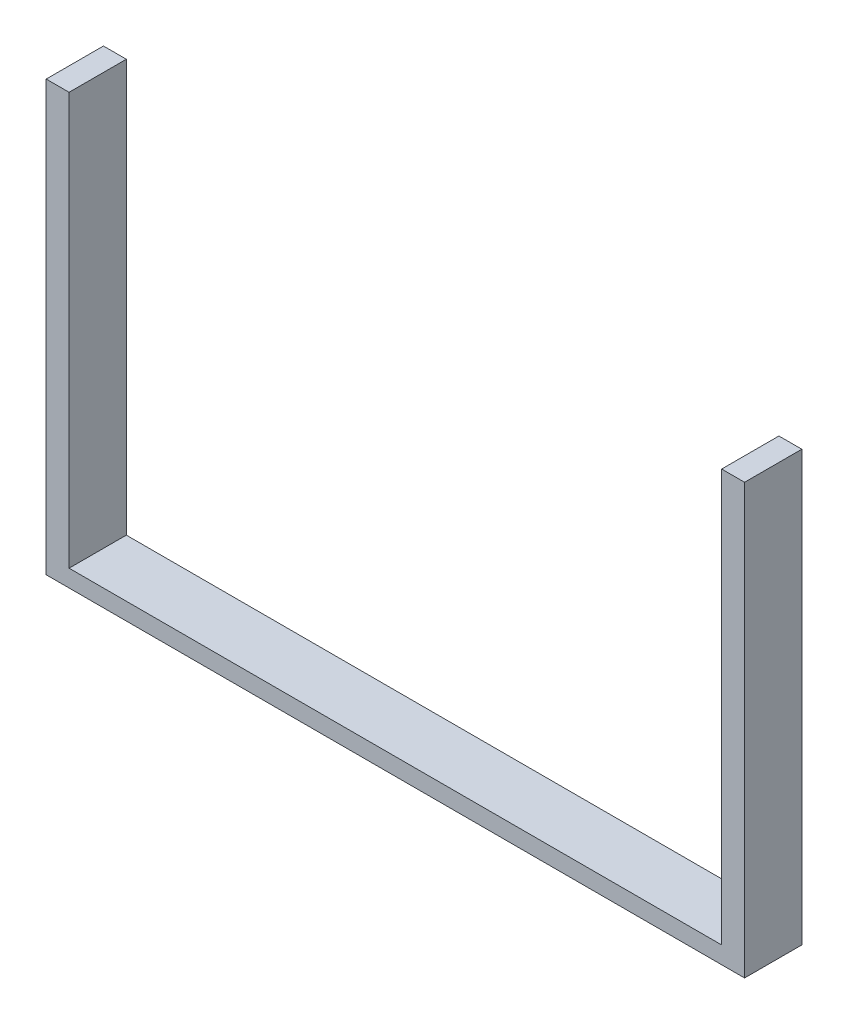
ISO-10303-21;
HEADER;
FILE_DESCRIPTION(('STEP AP214'),'2;1');
FILE_NAME('part.step','',(''),(''),'','','');
FILE_SCHEMA(('AUTOMOTIVE_DESIGN { 1 0 10303 214 1 1 1 1 }'));
ENDSEC;
DATA;
#1=APPLICATION_CONTEXT('core data for automotive mechanical design processes');
#2=APPLICATION_PROTOCOL_DEFINITION('international standard','automotive_design',2000,#1);
#3=PRODUCT_CONTEXT('',#1,'mechanical');
#4=PRODUCT('Part','Part','',(#3));
#5=PRODUCT_RELATED_PRODUCT_CATEGORY('part','',(#4));
#6=PRODUCT_DEFINITION_FORMATION('','',#4);
#7=PRODUCT_DEFINITION_CONTEXT('part definition',#1,'design');
#8=PRODUCT_DEFINITION('design','',#6,#7);
#9=PRODUCT_DEFINITION_SHAPE('','',#8);
#10=(LENGTH_UNIT() NAMED_UNIT(*) SI_UNIT(.MILLI.,.METRE.));
#11=(NAMED_UNIT(*) PLANE_ANGLE_UNIT() SI_UNIT($,.RADIAN.));
#12=(NAMED_UNIT(*) SI_UNIT($,.STERADIAN.) SOLID_ANGLE_UNIT());
#13=UNCERTAINTY_MEASURE_WITH_UNIT(LENGTH_MEASURE(1.E-05),#10,'distance_accuracy_value','');
#14=(GEOMETRIC_REPRESENTATION_CONTEXT(3) GLOBAL_UNCERTAINTY_ASSIGNED_CONTEXT((#13)) GLOBAL_UNIT_ASSIGNED_CONTEXT((#10,
#11,#12)) REPRESENTATION_CONTEXT('',''));
#15=CARTESIAN_POINT('',(0.,0.,0.));
#16=DIRECTION('',(0.,0.,1.));
#17=DIRECTION('',(1.,0.,0.));
#18=AXIS2_PLACEMENT_3D('',#15,#16,#17);
#19=CARTESIAN_POINT('',(-61.,3.,132.03687967168));
#20=DIRECTION('',(0.,-1.,0.));
#21=DIRECTION('',(0.,0.,-1.));
#22=AXIS2_PLACEMENT_3D('',#19,#20,#21);
#23=PLANE('',#22);
#24=DIRECTION('',(0.,0.,1.));
#25=VECTOR('',#24,1.);
#26=CARTESIAN_POINT('',(57.,3.,132.03687967168));
#27=LINE('',#26,#25);
#28=CARTESIAN_POINT('',(57.,3.,0.));
#29=VERTEX_POINT('',#28);
#30=CARTESIAN_POINT('',(57.,3.,9.99999999999999));
#31=VERTEX_POINT('',#30);
#32=EDGE_CURVE('E11',#29,#31,#27,.T.);
#33=ORIENTED_EDGE('',*,*,#32,.F.);
#34=DIRECTION('',(-1.,0.,0.));
#35=VECTOR('',#34,1.);
#36=CARTESIAN_POINT('',(-61.,3.,0.));
#37=LINE('',#36,#35);
#38=CARTESIAN_POINT('',(-57.,3.,0.));
#39=VERTEX_POINT('',#38);
#40=EDGE_CURVE('E117',#29,#39,#37,.T.);
#41=ORIENTED_EDGE('',*,*,#40,.T.);
#42=DIRECTION('',(0.,0.,1.));
#43=VECTOR('',#42,1.);
#44=CARTESIAN_POINT('',(-57.,3.,10.));
#45=LINE('',#44,#43);
#46=CARTESIAN_POINT('',(-57.,3.,10.));
#47=VERTEX_POINT('',#46);
#48=EDGE_CURVE('E122',#39,#47,#45,.T.);
#49=ORIENTED_EDGE('',*,*,#48,.T.);
#50=DIRECTION('',(1.,0.,0.));
#51=VECTOR('',#50,1.);
#52=CARTESIAN_POINT('',(-61.,3.,9.99999999999999));
#53=LINE('',#52,#51);
#54=EDGE_CURVE('E46',#47,#31,#53,.T.);
#55=ORIENTED_EDGE('',*,*,#54,.T.);
#56=EDGE_LOOP('',(#33,#41,#49,#55));
#57=FACE_BOUND('',#56,.T.);
#58=ADVANCED_FACE('F31',(#57),#23,.F.);
#59=CARTESIAN_POINT('',(-57.,75.,10.));
#60=DIRECTION('',(-1.,0.,0.));
#61=DIRECTION('',(0.,0.,1.));
#62=AXIS2_PLACEMENT_3D('',#59,#60,#61);
#63=PLANE('',#62);
#64=ORIENTED_EDGE('',*,*,#48,.F.);
#65=DIRECTION('',(0.,1.,0.));
#66=VECTOR('',#65,1.);
#67=CARTESIAN_POINT('',(-57.,75.,0.));
#68=LINE('',#67,#66);
#69=CARTESIAN_POINT('',(-57.,75.,0.));
#70=VERTEX_POINT('',#69);
#71=EDGE_CURVE('E135',#39,#70,#68,.T.);
#72=ORIENTED_EDGE('',*,*,#71,.T.);
#73=DIRECTION('',(0.,0.,-1.));
#74=VECTOR('',#73,1.);
#75=CARTESIAN_POINT('',(-57.,75.,10.));
#76=LINE('',#75,#74);
#77=CARTESIAN_POINT('',(-57.,75.,10.));
#78=VERTEX_POINT('',#77);
#79=EDGE_CURVE('E141',#78,#70,#76,.T.);
#80=ORIENTED_EDGE('',*,*,#79,.F.);
#81=DIRECTION('',(0.,1.,0.));
#82=VECTOR('',#81,1.);
#83=CARTESIAN_POINT('',(-57.,75.,10.));
#84=LINE('',#83,#82);
#85=EDGE_CURVE('E139',#47,#78,#84,.T.);
#86=ORIENTED_EDGE('',*,*,#85,.F.);
#87=EDGE_LOOP('',(#64,#72,#80,#86));
#88=FACE_BOUND('',#87,.T.);
#89=ADVANCED_FACE('F176',(#88),#63,.F.);
#90=CARTESIAN_POINT('',(-61.,75.,10.));
#91=DIRECTION('',(0.,-1.,0.));
#92=DIRECTION('',(0.,0.,-1.));
#93=AXIS2_PLACEMENT_3D('',#90,#91,#92);
#94=PLANE('',#93);
#95=DIRECTION('',(-1.,0.,0.));
#96=VECTOR('',#95,1.);
#97=CARTESIAN_POINT('',(-61.,75.,0.));
#98=LINE('',#97,#96);
#99=CARTESIAN_POINT('',(-61.,75.,0.));
#100=VERTEX_POINT('',#99);
#101=EDGE_CURVE('E130',#70,#100,#98,.T.);
#102=ORIENTED_EDGE('',*,*,#101,.T.);
#103=DIRECTION('',(0.,0.,-1.));
#104=VECTOR('',#103,1.);
#105=CARTESIAN_POINT('',(-61.,75.,10.));
#106=LINE('',#105,#104);
#107=CARTESIAN_POINT('',(-61.,75.,10.));
#108=VERTEX_POINT('',#107);
#109=EDGE_CURVE('E39',#108,#100,#106,.T.);
#110=ORIENTED_EDGE('',*,*,#109,.F.);
#111=DIRECTION('',(-1.,0.,0.));
#112=VECTOR('',#111,1.);
#113=CARTESIAN_POINT('',(-61.,75.,10.));
#114=LINE('',#113,#112);
#115=EDGE_CURVE('E131',#78,#108,#114,.T.);
#116=ORIENTED_EDGE('',*,*,#115,.F.);
#117=ORIENTED_EDGE('',*,*,#79,.T.);
#118=EDGE_LOOP('',(#102,#110,#116,#117));
#119=FACE_BOUND('',#118,.T.);
#120=ADVANCED_FACE('F33',(#119),#94,.F.);
#121=CARTESIAN_POINT('',(-61.,75.,10.));
#122=DIRECTION('',(1.,0.,0.));
#123=DIRECTION('',(0.,0.,-1.));
#124=AXIS2_PLACEMENT_3D('',#121,#122,#123);
#125=PLANE('',#124);
#126=DIRECTION('',(0.,0.,-1.));
#127=VECTOR('',#126,1.);
#128=CARTESIAN_POINT('',(-61.,0.,10.));
#129=LINE('',#128,#127);
#130=CARTESIAN_POINT('',(-61.,0.,10.));
#131=VERTEX_POINT('',#130);
#132=CARTESIAN_POINT('',(-61.,0.,0.));
#133=VERTEX_POINT('',#132);
#134=EDGE_CURVE('E151',#131,#133,#129,.T.);
#135=ORIENTED_EDGE('',*,*,#134,.F.);
#136=DIRECTION('',(0.,-1.,0.));
#137=VECTOR('',#136,1.);
#138=CARTESIAN_POINT('',(-61.,75.,10.));
#139=LINE('',#138,#137);
#140=EDGE_CURVE('E134',#108,#131,#139,.T.);
#141=ORIENTED_EDGE('',*,*,#140,.F.);
#142=ORIENTED_EDGE('',*,*,#109,.T.);
#143=DIRECTION('',(0.,-1.,0.));
#144=VECTOR('',#143,1.);
#145=CARTESIAN_POINT('',(-61.,75.,0.));
#146=LINE('',#145,#144);
#147=EDGE_CURVE('E144',#100,#133,#146,.T.);
#148=ORIENTED_EDGE('',*,*,#147,.T.);
#149=EDGE_LOOP('',(#135,#141,#142,#148));
#150=FACE_BOUND('',#149,.T.);
#151=ADVANCED_FACE('F157',(#150),#125,.F.);
#152=CARTESIAN_POINT('',(-57.,0.,10.));
#153=DIRECTION('',(0.,1.,0.));
#154=DIRECTION('',(-1.,0.,0.));
#155=AXIS2_PLACEMENT_3D('',#152,#153,#154);
#156=PLANE('',#155);
#157=DIRECTION('',(0.,0.,-1.));
#158=VECTOR('',#157,1.);
#159=CARTESIAN_POINT('',(61.,0.,132.03687967168));
#160=LINE('',#159,#158);
#161=CARTESIAN_POINT('',(61.,0.,9.99999999999999));
#162=VERTEX_POINT('',#161);
#163=CARTESIAN_POINT('',(61.,0.,0.));
#164=VERTEX_POINT('',#163);
#165=EDGE_CURVE('E125',#162,#164,#160,.T.);
#166=ORIENTED_EDGE('',*,*,#165,.F.);
#167=DIRECTION('',(1.,0.,0.));
#168=VECTOR('',#167,1.);
#169=CARTESIAN_POINT('',(-57.,0.,10.));
#170=LINE('',#169,#168);
#171=EDGE_CURVE('E137',#131,#162,#170,.T.);
#172=ORIENTED_EDGE('',*,*,#171,.F.);
#173=ORIENTED_EDGE('',*,*,#134,.T.);
#174=DIRECTION('',(1.,0.,0.));
#175=VECTOR('',#174,1.);
#176=CARTESIAN_POINT('',(-57.,0.,0.));
#177=LINE('',#176,#175);
#178=EDGE_CURVE('E146',#133,#164,#177,.T.);
#179=ORIENTED_EDGE('',*,*,#178,.T.);
#180=EDGE_LOOP('',(#166,#172,#173,#179));
#181=FACE_BOUND('',#180,.T.);
#182=ADVANCED_FACE('F169',(#181),#156,.F.);
#183=CARTESIAN_POINT('',(-57.,75.,10.));
#184=DIRECTION('',(0.,0.,-1.));
#185=DIRECTION('',(-1.,0.,0.));
#186=AXIS2_PLACEMENT_3D('',#183,#184,#185);
#187=PLANE('',#186);
#188=DIRECTION('',(0.,-1.,0.));
#189=VECTOR('',#188,1.);
#190=CARTESIAN_POINT('',(61.,0.,9.99999999999999));
#191=LINE('',#190,#189);
#192=CARTESIAN_POINT('',(61.,75.,10.));
#193=VERTEX_POINT('',#192);
#194=EDGE_CURVE('E106',#193,#162,#191,.T.);
#195=ORIENTED_EDGE('',*,*,#194,.F.);
#196=DIRECTION('',(-1.,0.,0.));
#197=VECTOR('',#196,1.);
#198=CARTESIAN_POINT('',(61.,75.,10.));
#199=LINE('',#198,#197);
#200=CARTESIAN_POINT('',(57.,75.,10.));
#201=VERTEX_POINT('',#200);
#202=EDGE_CURVE('E101',#193,#201,#199,.T.);
#203=ORIENTED_EDGE('',*,*,#202,.T.);
#204=DIRECTION('',(0.,-1.,0.));
#205=VECTOR('',#204,1.);
#206=CARTESIAN_POINT('',(57.,75.,10.));
#207=LINE('',#206,#205);
#208=EDGE_CURVE('E93',#201,#31,#207,.T.);
#209=ORIENTED_EDGE('',*,*,#208,.T.);
#210=ORIENTED_EDGE('',*,*,#54,.F.);
#211=ORIENTED_EDGE('',*,*,#85,.T.);
#212=ORIENTED_EDGE('',*,*,#115,.T.);
#213=ORIENTED_EDGE('',*,*,#140,.T.);
#214=ORIENTED_EDGE('',*,*,#171,.T.);
#215=EDGE_LOOP('',(#195,#203,#209,#210,#211,#212,#213,#214));
#216=FACE_BOUND('',#215,.T.);
#217=ADVANCED_FACE('F104',(#216),#187,.F.);
#218=CARTESIAN_POINT('',(-57.,75.,0.));
#219=DIRECTION('',(0.,0.,-1.));
#220=DIRECTION('',(-1.,0.,0.));
#221=AXIS2_PLACEMENT_3D('',#218,#219,#220);
#222=PLANE('',#221);
#223=DIRECTION('',(0.,1.,0.));
#224=VECTOR('',#223,1.);
#225=CARTESIAN_POINT('',(61.,0.,0.));
#226=LINE('',#225,#224);
#227=CARTESIAN_POINT('',(61.,75.,0.));
#228=VERTEX_POINT('',#227);
#229=EDGE_CURVE('E115',#164,#228,#226,.T.);
#230=ORIENTED_EDGE('',*,*,#229,.F.);
#231=ORIENTED_EDGE('',*,*,#178,.F.);
#232=ORIENTED_EDGE('',*,*,#147,.F.);
#233=ORIENTED_EDGE('',*,*,#101,.F.);
#234=ORIENTED_EDGE('',*,*,#71,.F.);
#235=ORIENTED_EDGE('',*,*,#40,.F.);
#236=DIRECTION('',(0.,-1.,0.));
#237=VECTOR('',#236,1.);
#238=CARTESIAN_POINT('',(57.,75.,0.));
#239=LINE('',#238,#237);
#240=CARTESIAN_POINT('',(57.,75.,0.));
#241=VERTEX_POINT('',#240);
#242=EDGE_CURVE('E110',#241,#29,#239,.T.);
#243=ORIENTED_EDGE('',*,*,#242,.F.);
#244=DIRECTION('',(-1.,0.,0.));
#245=VECTOR('',#244,1.);
#246=CARTESIAN_POINT('',(61.,75.,0.));
#247=LINE('',#246,#245);
#248=EDGE_CURVE('E114',#228,#241,#247,.T.);
#249=ORIENTED_EDGE('',*,*,#248,.F.);
#250=EDGE_LOOP('',(#230,#231,#232,#233,#234,#235,#243,#249));
#251=FACE_BOUND('',#250,.T.);
#252=ADVANCED_FACE('F165',(#251),#222,.T.);
#253=CARTESIAN_POINT('',(61.,0.,132.03687967168));
#254=DIRECTION('',(-1.,0.,0.));
#255=DIRECTION('',(0.,0.,1.));
#256=AXIS2_PLACEMENT_3D('',#253,#254,#255);
#257=PLANE('',#256);
#258=ORIENTED_EDGE('',*,*,#229,.T.);
#259=DIRECTION('',(0.,0.,-1.));
#260=VECTOR('',#259,1.);
#261=CARTESIAN_POINT('',(61.,75.,10.));
#262=LINE('',#261,#260);
#263=EDGE_CURVE('E100',#193,#228,#262,.T.);
#264=ORIENTED_EDGE('',*,*,#263,.F.);
#265=ORIENTED_EDGE('',*,*,#194,.T.);
#266=ORIENTED_EDGE('',*,*,#165,.T.);
#267=EDGE_LOOP('',(#258,#264,#265,#266));
#268=FACE_BOUND('',#267,.T.);
#269=ADVANCED_FACE('F172',(#268),#257,.F.);
#270=CARTESIAN_POINT('',(57.,75.,10.));
#271=DIRECTION('',(1.,0.,0.));
#272=DIRECTION('',(0.,0.,-1.));
#273=AXIS2_PLACEMENT_3D('',#270,#271,#272);
#274=PLANE('',#273);
#275=ORIENTED_EDGE('',*,*,#242,.T.);
#276=ORIENTED_EDGE('',*,*,#32,.T.);
#277=ORIENTED_EDGE('',*,*,#208,.F.);
#278=DIRECTION('',(0.,0.,-1.));
#279=VECTOR('',#278,1.);
#280=CARTESIAN_POINT('',(57.,75.,10.));
#281=LINE('',#280,#279);
#282=EDGE_CURVE('E98',#201,#241,#281,.T.);
#283=ORIENTED_EDGE('',*,*,#282,.T.);
#284=EDGE_LOOP('',(#275,#276,#277,#283));
#285=FACE_BOUND('',#284,.T.);
#286=ADVANCED_FACE('F96',(#285),#274,.F.);
#287=CARTESIAN_POINT('',(61.,75.,10.));
#288=DIRECTION('',(0.,-1.,0.));
#289=DIRECTION('',(0.,0.,-1.));
#290=AXIS2_PLACEMENT_3D('',#287,#288,#289);
#291=PLANE('',#290);
#292=ORIENTED_EDGE('',*,*,#248,.T.);
#293=ORIENTED_EDGE('',*,*,#282,.F.);
#294=ORIENTED_EDGE('',*,*,#202,.F.);
#295=ORIENTED_EDGE('',*,*,#263,.T.);
#296=EDGE_LOOP('',(#292,#293,#294,#295));
#297=FACE_BOUND('',#296,.T.);
#298=ADVANCED_FACE('F112',(#297),#291,.F.);
#299=CLOSED_SHELL('',(#58,#89,#120,#151,#182,#217,#252,#269,#286,#298));
#300=MANIFOLD_SOLID_BREP('B2',#299);
#301=ADVANCED_BREP_SHAPE_REPRESENTATION('',(#18,#300),#14);
#302=SHAPE_DEFINITION_REPRESENTATION(#9,#301);
ENDSEC;
END-ISO-10303-21;
